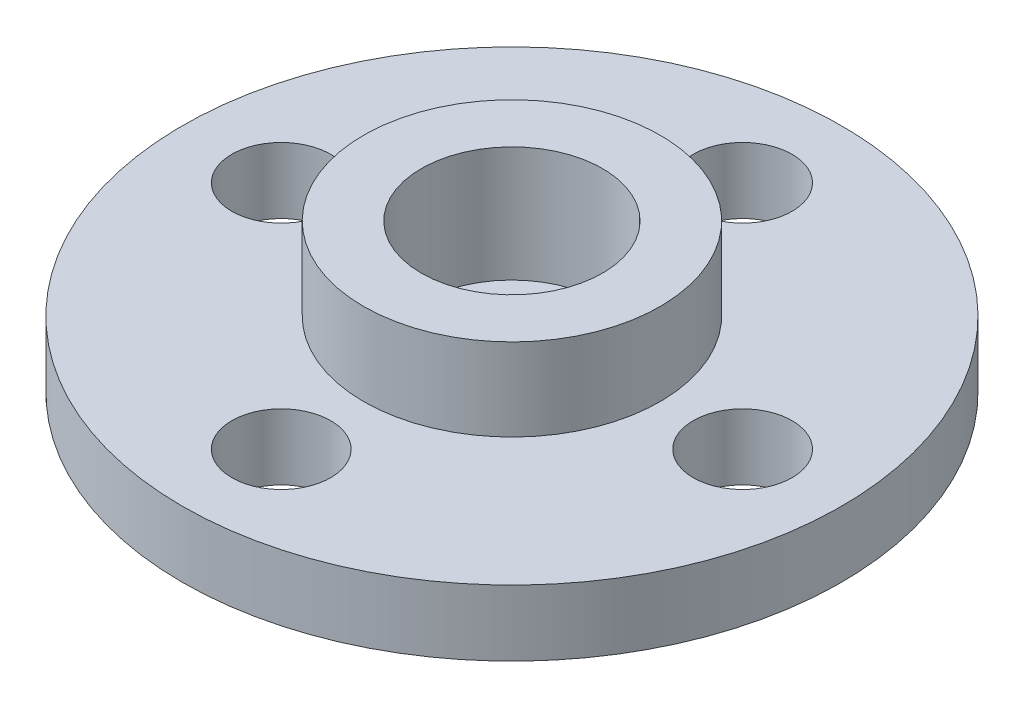
ISO-10303-21;
HEADER;
FILE_DESCRIPTION(('STEP AP214'),'2;1');
FILE_NAME('part.step','',(''),(''),'','','');
FILE_SCHEMA(('AUTOMOTIVE_DESIGN { 1 0 10303 214 1 1 1 1 }'));
ENDSEC;
DATA;
#1=APPLICATION_CONTEXT('core data for automotive mechanical design processes');
#2=APPLICATION_PROTOCOL_DEFINITION('international standard','automotive_design',2000,#1);
#3=PRODUCT_CONTEXT('',#1,'mechanical');
#4=PRODUCT('Part','Part','',(#3));
#5=PRODUCT_RELATED_PRODUCT_CATEGORY('part','',(#4));
#6=PRODUCT_DEFINITION_FORMATION('','',#4);
#7=PRODUCT_DEFINITION_CONTEXT('part definition',#1,'design');
#8=PRODUCT_DEFINITION('design','',#6,#7);
#9=PRODUCT_DEFINITION_SHAPE('','',#8);
#10=(LENGTH_UNIT() NAMED_UNIT(*) SI_UNIT(.MILLI.,.METRE.));
#11=(NAMED_UNIT(*) PLANE_ANGLE_UNIT() SI_UNIT($,.RADIAN.));
#12=(NAMED_UNIT(*) SI_UNIT($,.STERADIAN.) SOLID_ANGLE_UNIT());
#13=UNCERTAINTY_MEASURE_WITH_UNIT(LENGTH_MEASURE(1.E-05),#10,'distance_accuracy_value','');
#14=(GEOMETRIC_REPRESENTATION_CONTEXT(3) GLOBAL_UNCERTAINTY_ASSIGNED_CONTEXT((#13)) GLOBAL_UNIT_ASSIGNED_CONTEXT((#10,
#11,#12)) REPRESENTATION_CONTEXT('',''));
#15=CARTESIAN_POINT('',(0.,0.,0.));
#16=DIRECTION('',(0.,0.,1.));
#17=DIRECTION('',(1.,0.,0.));
#18=AXIS2_PLACEMENT_3D('',#15,#16,#17);
#19=CARTESIAN_POINT('',(0.,2.,0.));
#20=DIRECTION('',(0.,-1.,0.));
#21=DIRECTION('',(0.,0.,-1.));
#22=AXIS2_PLACEMENT_3D('',#19,#20,#21);
#23=CYLINDRICAL_SURFACE('',#22,10.);
#24=CARTESIAN_POINT('',(0.,2.,0.));
#25=DIRECTION('',(0.,1.,0.));
#26=DIRECTION('',(0.,0.,1.));
#27=AXIS2_PLACEMENT_3D('',#24,#25,#26);
#28=CIRCLE('',#27,10.);
#29=CARTESIAN_POINT('',(0.,2.,10.));
#30=VERTEX_POINT('',#29);
#31=EDGE_CURVE('E39',#30,#30,#28,.T.);
#32=ORIENTED_EDGE('',*,*,#31,.F.);
#33=EDGE_LOOP('',(#32));
#34=FACE_BOUND('',#33,.T.);
#35=CARTESIAN_POINT('',(0.,0.,0.));
#36=DIRECTION('',(0.,1.,0.));
#37=DIRECTION('',(0.,0.,1.));
#38=AXIS2_PLACEMENT_3D('',#35,#36,#37);
#39=CIRCLE('',#38,10.);
#40=CARTESIAN_POINT('',(0.,0.,10.));
#41=VERTEX_POINT('',#40);
#42=EDGE_CURVE('E35',#41,#41,#39,.T.);
#43=ORIENTED_EDGE('',*,*,#42,.T.);
#44=EDGE_LOOP('',(#43));
#45=FACE_BOUND('',#44,.T.);
#46=ADVANCED_FACE('F32',(#34,#45),#23,.T.);
#47=CARTESIAN_POINT('',(0.,2.,0.));
#48=DIRECTION('',(0.,1.,0.));
#49=DIRECTION('',(0.,0.,1.));
#50=AXIS2_PLACEMENT_3D('',#47,#48,#49);
#51=PLANE('',#50);
#52=CARTESIAN_POINT('',(0.,2.,-7.));
#53=DIRECTION('',(0.,1.,0.));
#54=DIRECTION('',(0.,0.,1.));
#55=AXIS2_PLACEMENT_3D('',#52,#53,#54);
#56=CIRCLE('',#55,1.5);
#57=CARTESIAN_POINT('',(0.,2.,-5.5));
#58=VERTEX_POINT('',#57);
#59=EDGE_CURVE('E79',#58,#58,#56,.T.);
#60=ORIENTED_EDGE('',*,*,#59,.F.);
#61=EDGE_LOOP('',(#60));
#62=FACE_BOUND('',#61,.T.);
#63=CARTESIAN_POINT('',(7.0000000000002,2.,-1.98094713253425E-13));
#64=DIRECTION('',(0.,1.,0.));
#65=DIRECTION('',(0.,0.,1.));
#66=AXIS2_PLACEMENT_3D('',#63,#64,#65);
#67=CIRCLE('',#66,1.50000000000015);
#68=CARTESIAN_POINT('',(7.0000000000002,2.,1.49999999999996));
#69=VERTEX_POINT('',#68);
#70=EDGE_CURVE('E73',#69,#69,#67,.T.);
#71=ORIENTED_EDGE('',*,*,#70,.F.);
#72=EDGE_LOOP('',(#71));
#73=FACE_BOUND('',#72,.T.);
#74=CARTESIAN_POINT('',(3.9618942650685E-13,2.,7.));
#75=DIRECTION('',(0.,1.,0.));
#76=DIRECTION('',(0.,0.,1.));
#77=AXIS2_PLACEMENT_3D('',#74,#75,#76);
#78=CIRCLE('',#77,1.50000000000043);
#79=CARTESIAN_POINT('',(3.9618942650685E-13,2.,8.50000000000043));
#80=VERTEX_POINT('',#79);
#81=EDGE_CURVE('E67',#80,#80,#78,.T.);
#82=ORIENTED_EDGE('',*,*,#81,.F.);
#83=EDGE_LOOP('',(#82));
#84=FACE_BOUND('',#83,.T.);
#85=CARTESIAN_POINT('',(-6.9999999999998,2.,1.98951966012828E-13));
#86=DIRECTION('',(0.,1.,0.));
#87=DIRECTION('',(0.,0.,1.));
#88=AXIS2_PLACEMENT_3D('',#85,#86,#87);
#89=CIRCLE('',#88,1.50000000000032);
#90=CARTESIAN_POINT('',(-6.9999999999998,2.,1.50000000000052));
#91=VERTEX_POINT('',#90);
#92=EDGE_CURVE('E61',#91,#91,#89,.T.);
#93=ORIENTED_EDGE('',*,*,#92,.F.);
#94=EDGE_LOOP('',(#93));
#95=FACE_BOUND('',#94,.T.);
#96=CARTESIAN_POINT('',(0.,2.,0.));
#97=DIRECTION('',(0.,1.,0.));
#98=DIRECTION('',(0.,0.,1.));
#99=AXIS2_PLACEMENT_3D('',#96,#97,#98);
#100=CIRCLE('',#99,4.5);
#101=CARTESIAN_POINT('',(0.,2.,4.5));
#102=VERTEX_POINT('',#101);
#103=EDGE_CURVE('E10',#102,#102,#100,.T.);
#104=ORIENTED_EDGE('',*,*,#103,.F.);
#105=EDGE_LOOP('',(#104));
#106=FACE_BOUND('',#105,.T.);
#107=ORIENTED_EDGE('',*,*,#31,.T.);
#108=EDGE_LOOP('',(#107));
#109=FACE_BOUND('',#108,.T.);
#110=ADVANCED_FACE('F95',(#62,#73,#84,#95,#106,#109),#51,.T.);
#111=CARTESIAN_POINT('',(0.,0.,0.));
#112=DIRECTION('',(0.,1.,0.));
#113=DIRECTION('',(0.,0.,1.));
#114=AXIS2_PLACEMENT_3D('',#111,#112,#113);
#115=PLANE('',#114);
#116=CARTESIAN_POINT('',(0.,0.,-7.));
#117=DIRECTION('',(0.,1.,0.));
#118=DIRECTION('',(0.,0.,1.));
#119=AXIS2_PLACEMENT_3D('',#116,#117,#118);
#120=CIRCLE('',#119,1.5);
#121=CARTESIAN_POINT('',(0.,0.,-5.5));
#122=VERTEX_POINT('',#121);
#123=EDGE_CURVE('E58',#122,#122,#120,.T.);
#124=ORIENTED_EDGE('',*,*,#123,.T.);
#125=EDGE_LOOP('',(#124));
#126=FACE_BOUND('',#125,.T.);
#127=CARTESIAN_POINT('',(7.0000000000002,0.,-1.98094713253425E-13));
#128=DIRECTION('',(0.,1.,0.));
#129=DIRECTION('',(0.,0.,1.));
#130=AXIS2_PLACEMENT_3D('',#127,#128,#129);
#131=CIRCLE('',#130,1.50000000000015);
#132=CARTESIAN_POINT('',(7.0000000000002,0.,1.49999999999996));
#133=VERTEX_POINT('',#132);
#134=EDGE_CURVE('E76',#133,#133,#131,.T.);
#135=ORIENTED_EDGE('',*,*,#134,.T.);
#136=EDGE_LOOP('',(#135));
#137=FACE_BOUND('',#136,.T.);
#138=CARTESIAN_POINT('',(3.9618942650685E-13,0.,7.));
#139=DIRECTION('',(0.,1.,0.));
#140=DIRECTION('',(0.,0.,1.));
#141=AXIS2_PLACEMENT_3D('',#138,#139,#140);
#142=CIRCLE('',#141,1.50000000000043);
#143=CARTESIAN_POINT('',(3.9618942650685E-13,0.,8.50000000000043));
#144=VERTEX_POINT('',#143);
#145=EDGE_CURVE('E70',#144,#144,#142,.T.);
#146=ORIENTED_EDGE('',*,*,#145,.T.);
#147=EDGE_LOOP('',(#146));
#148=FACE_BOUND('',#147,.T.);
#149=CARTESIAN_POINT('',(-6.9999999999998,0.,1.98951966012828E-13));
#150=DIRECTION('',(0.,1.,0.));
#151=DIRECTION('',(0.,0.,1.));
#152=AXIS2_PLACEMENT_3D('',#149,#150,#151);
#153=CIRCLE('',#152,1.50000000000032);
#154=CARTESIAN_POINT('',(-6.9999999999998,0.,1.50000000000052));
#155=VERTEX_POINT('',#154);
#156=EDGE_CURVE('E64',#155,#155,#153,.T.);
#157=ORIENTED_EDGE('',*,*,#156,.T.);
#158=EDGE_LOOP('',(#157));
#159=FACE_BOUND('',#158,.T.);
#160=CARTESIAN_POINT('',(0.,0.,0.));
#161=DIRECTION('',(0.,1.,0.));
#162=DIRECTION('',(0.,0.,1.));
#163=AXIS2_PLACEMENT_3D('',#160,#161,#162);
#164=CIRCLE('',#163,1.5);
#165=CARTESIAN_POINT('',(0.,0.,1.5));
#166=VERTEX_POINT('',#165);
#167=EDGE_CURVE('E52',#166,#166,#164,.T.);
#168=ORIENTED_EDGE('',*,*,#167,.T.);
#169=EDGE_LOOP('',(#168));
#170=FACE_BOUND('',#169,.T.);
#171=ORIENTED_EDGE('',*,*,#42,.F.);
#172=EDGE_LOOP('',(#171));
#173=FACE_BOUND('',#172,.T.);
#174=ADVANCED_FACE('F85',(#126,#137,#148,#159,#170,#173),#115,.F.);
#175=CARTESIAN_POINT('',(0.,4.5,0.));
#176=DIRECTION('',(0.,-1.,0.));
#177=DIRECTION('',(0.,0.,-1.));
#178=AXIS2_PLACEMENT_3D('',#175,#176,#177);
#179=CYLINDRICAL_SURFACE('',#178,4.5);
#180=CARTESIAN_POINT('',(0.,4.5,0.));
#181=DIRECTION('',(0.,1.,0.));
#182=DIRECTION('',(0.,0.,1.));
#183=AXIS2_PLACEMENT_3D('',#180,#181,#182);
#184=CIRCLE('',#183,4.5);
#185=CARTESIAN_POINT('',(0.,4.5,4.5));
#186=VERTEX_POINT('',#185);
#187=EDGE_CURVE('E45',#186,#186,#184,.T.);
#188=ORIENTED_EDGE('',*,*,#187,.F.);
#189=EDGE_LOOP('',(#188));
#190=FACE_BOUND('',#189,.T.);
#191=ORIENTED_EDGE('',*,*,#103,.T.);
#192=EDGE_LOOP('',(#191));
#193=FACE_BOUND('',#192,.T.);
#194=ADVANCED_FACE('F114',(#190,#193),#179,.T.);
#195=CARTESIAN_POINT('',(0.,4.5,0.));
#196=DIRECTION('',(0.,1.,0.));
#197=DIRECTION('',(0.,0.,1.));
#198=AXIS2_PLACEMENT_3D('',#195,#196,#197);
#199=PLANE('',#198);
#200=CARTESIAN_POINT('',(0.,4.5,0.));
#201=DIRECTION('',(0.,1.,0.));
#202=DIRECTION('',(0.,0.,1.));
#203=AXIS2_PLACEMENT_3D('',#200,#201,#202);
#204=CIRCLE('',#203,2.75);
#205=CARTESIAN_POINT('',(0.,4.5,2.75));
#206=VERTEX_POINT('',#205);
#207=EDGE_CURVE('E49',#206,#206,#204,.T.);
#208=ORIENTED_EDGE('',*,*,#207,.F.);
#209=EDGE_LOOP('',(#208));
#210=FACE_BOUND('',#209,.T.);
#211=ORIENTED_EDGE('',*,*,#187,.T.);
#212=EDGE_LOOP('',(#211));
#213=FACE_BOUND('',#212,.T.);
#214=ADVANCED_FACE('F118',(#210,#213),#199,.T.);
#215=CARTESIAN_POINT('',(0.,1.,0.));
#216=DIRECTION('',(0.,1.,0.));
#217=DIRECTION('',(0.,0.,1.));
#218=AXIS2_PLACEMENT_3D('',#215,#216,#217);
#219=CYLINDRICAL_SURFACE('',#218,2.75);
#220=CARTESIAN_POINT('',(0.,1.,0.));
#221=DIRECTION('',(0.,1.,0.));
#222=DIRECTION('',(0.,0.,1.));
#223=AXIS2_PLACEMENT_3D('',#220,#221,#222);
#224=CIRCLE('',#223,2.75);
#225=CARTESIAN_POINT('',(0.,1.,2.75));
#226=VERTEX_POINT('',#225);
#227=EDGE_CURVE('E48',#226,#226,#224,.T.);
#228=ORIENTED_EDGE('',*,*,#227,.F.);
#229=EDGE_LOOP('',(#228));
#230=FACE_BOUND('',#229,.T.);
#231=ORIENTED_EDGE('',*,*,#207,.T.);
#232=EDGE_LOOP('',(#231));
#233=FACE_BOUND('',#232,.T.);
#234=ADVANCED_FACE('F124',(#230,#233),#219,.F.);
#235=CARTESIAN_POINT('',(0.,1.,0.));
#236=DIRECTION('',(0.,1.,0.));
#237=DIRECTION('',(0.,0.,1.));
#238=AXIS2_PLACEMENT_3D('',#235,#236,#237);
#239=PLANE('',#238);
#240=CARTESIAN_POINT('',(0.,1.,0.));
#241=DIRECTION('',(0.,1.,0.));
#242=DIRECTION('',(0.,0.,1.));
#243=AXIS2_PLACEMENT_3D('',#240,#241,#242);
#244=CIRCLE('',#243,1.5);
#245=CARTESIAN_POINT('',(0.,1.,1.5));
#246=VERTEX_POINT('',#245);
#247=EDGE_CURVE('E55',#246,#246,#244,.T.);
#248=ORIENTED_EDGE('',*,*,#247,.F.);
#249=EDGE_LOOP('',(#248));
#250=FACE_BOUND('',#249,.T.);
#251=ORIENTED_EDGE('',*,*,#227,.T.);
#252=EDGE_LOOP('',(#251));
#253=FACE_BOUND('',#252,.T.);
#254=ADVANCED_FACE('F128',(#250,#253),#239,.T.);
#255=CARTESIAN_POINT('',(0.,0.,0.));
#256=DIRECTION('',(0.,1.,0.));
#257=DIRECTION('',(0.,0.,1.));
#258=AXIS2_PLACEMENT_3D('',#255,#256,#257);
#259=CYLINDRICAL_SURFACE('',#258,1.5);
#260=ORIENTED_EDGE('',*,*,#167,.F.);
#261=EDGE_LOOP('',(#260));
#262=FACE_BOUND('',#261,.T.);
#263=ORIENTED_EDGE('',*,*,#247,.T.);
#264=EDGE_LOOP('',(#263));
#265=FACE_BOUND('',#264,.T.);
#266=ADVANCED_FACE('F132',(#262,#265),#259,.F.);
#267=CARTESIAN_POINT('',(-6.9999999999998,0.,1.98951966012828E-13));
#268=DIRECTION('',(0.,1.,0.));
#269=DIRECTION('',(0.,0.,1.));
#270=AXIS2_PLACEMENT_3D('',#267,#268,#269);
#271=CYLINDRICAL_SURFACE('',#270,1.50000000000032);
#272=ORIENTED_EDGE('',*,*,#156,.F.);
#273=EDGE_LOOP('',(#272));
#274=FACE_BOUND('',#273,.T.);
#275=ORIENTED_EDGE('',*,*,#92,.T.);
#276=EDGE_LOOP('',(#275));
#277=FACE_BOUND('',#276,.T.);
#278=ADVANCED_FACE('F136',(#274,#277),#271,.F.);
#279=CARTESIAN_POINT('',(3.9618942650685E-13,0.,7.));
#280=DIRECTION('',(0.,1.,0.));
#281=DIRECTION('',(0.,0.,1.));
#282=AXIS2_PLACEMENT_3D('',#279,#280,#281);
#283=CYLINDRICAL_SURFACE('',#282,1.50000000000043);
#284=ORIENTED_EDGE('',*,*,#145,.F.);
#285=EDGE_LOOP('',(#284));
#286=FACE_BOUND('',#285,.T.);
#287=ORIENTED_EDGE('',*,*,#81,.T.);
#288=EDGE_LOOP('',(#287));
#289=FACE_BOUND('',#288,.T.);
#290=ADVANCED_FACE('F140',(#286,#289),#283,.F.);
#291=CARTESIAN_POINT('',(7.0000000000002,0.,-1.98094713253425E-13));
#292=DIRECTION('',(0.,1.,0.));
#293=DIRECTION('',(0.,0.,1.));
#294=AXIS2_PLACEMENT_3D('',#291,#292,#293);
#295=CYLINDRICAL_SURFACE('',#294,1.50000000000015);
#296=ORIENTED_EDGE('',*,*,#134,.F.);
#297=EDGE_LOOP('',(#296));
#298=FACE_BOUND('',#297,.T.);
#299=ORIENTED_EDGE('',*,*,#70,.T.);
#300=EDGE_LOOP('',(#299));
#301=FACE_BOUND('',#300,.T.);
#302=ADVANCED_FACE('F91',(#298,#301),#295,.F.);
#303=CARTESIAN_POINT('',(0.,0.,-7.));
#304=DIRECTION('',(0.,1.,0.));
#305=DIRECTION('',(0.,0.,1.));
#306=AXIS2_PLACEMENT_3D('',#303,#304,#305);
#307=CYLINDRICAL_SURFACE('',#306,1.5);
#308=ORIENTED_EDGE('',*,*,#123,.F.);
#309=EDGE_LOOP('',(#308));
#310=FACE_BOUND('',#309,.T.);
#311=ORIENTED_EDGE('',*,*,#59,.T.);
#312=EDGE_LOOP('',(#311));
#313=FACE_BOUND('',#312,.T.);
#314=ADVANCED_FACE('F88',(#310,#313),#307,.F.);
#315=CLOSED_SHELL('',(#46,#110,#174,#194,#214,#234,#254,#266,#278,#290,#302,#314));
#316=MANIFOLD_SOLID_BREP('B2',#315);
#317=ADVANCED_BREP_SHAPE_REPRESENTATION('',(#18,#316),#14);
#318=SHAPE_DEFINITION_REPRESENTATION(#9,#317);
ENDSEC;
END-ISO-10303-21;
